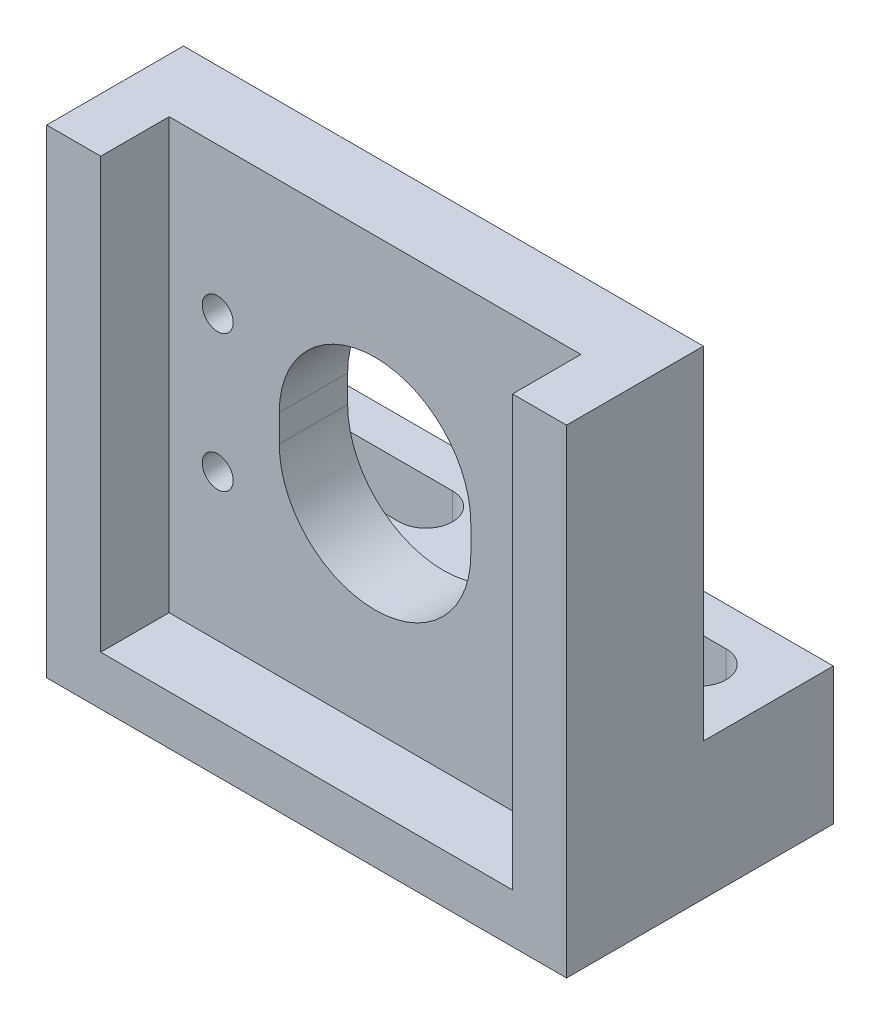
ISO-10303-21;
HEADER;
FILE_DESCRIPTION(('STEP AP214'),'2;1');
FILE_NAME('part.step','',(''),(''),'','','');
FILE_SCHEMA(('AUTOMOTIVE_DESIGN { 1 0 10303 214 1 1 1 1 }'));
ENDSEC;
DATA;
#1=APPLICATION_CONTEXT('core data for automotive mechanical design processes');
#2=APPLICATION_PROTOCOL_DEFINITION('international standard','automotive_design',2000,#1);
#3=PRODUCT_CONTEXT('',#1,'mechanical');
#4=PRODUCT('Part','Part','',(#3));
#5=PRODUCT_RELATED_PRODUCT_CATEGORY('part','',(#4));
#6=PRODUCT_DEFINITION_FORMATION('','',#4);
#7=PRODUCT_DEFINITION_CONTEXT('part definition',#1,'design');
#8=PRODUCT_DEFINITION('design','',#6,#7);
#9=PRODUCT_DEFINITION_SHAPE('','',#8);
#10=(LENGTH_UNIT() NAMED_UNIT(*) SI_UNIT(.MILLI.,.METRE.));
#11=(NAMED_UNIT(*) PLANE_ANGLE_UNIT() SI_UNIT($,.RADIAN.));
#12=(NAMED_UNIT(*) SI_UNIT($,.STERADIAN.) SOLID_ANGLE_UNIT());
#13=UNCERTAINTY_MEASURE_WITH_UNIT(LENGTH_MEASURE(1.E-05),#10,'distance_accuracy_value','');
#14=(GEOMETRIC_REPRESENTATION_CONTEXT(3) GLOBAL_UNCERTAINTY_ASSIGNED_CONTEXT((#13)) GLOBAL_UNIT_ASSIGNED_CONTEXT((#10,
#11,#12)) REPRESENTATION_CONTEXT('',''));
#15=CARTESIAN_POINT('',(0.,0.,0.));
#16=DIRECTION('',(0.,0.,1.));
#17=DIRECTION('',(1.,0.,0.));
#18=AXIS2_PLACEMENT_3D('',#15,#16,#17);
#19=CARTESIAN_POINT('',(-0.223776223776072,0.,-44.0569440559441));
#20=DIRECTION('',(1.,0.,0.));
#21=DIRECTION('',(0.,1.,0.));
#22=AXIS2_PLACEMENT_3D('',#19,#20,#21);
#23=PLANE('',#22);
#24=DIRECTION('',(0.,-1.,0.));
#25=VECTOR('',#24,1.);
#26=CARTESIAN_POINT('',(-0.223776223776072,0.,-29.5559440559441));
#27=LINE('',#26,#25);
#28=CARTESIAN_POINT('',(-0.223776223776214,20.3,-29.5559440559441));
#29=VERTEX_POINT('',#28);
#30=CARTESIAN_POINT('',(-0.223776223776203,18.3000000000001,-29.5559440559441));
#31=VERTEX_POINT('',#30);
#32=EDGE_CURVE('E89',#29,#31,#27,.T.);
#33=ORIENTED_EDGE('',*,*,#32,.F.);
#34=DIRECTION('',(0.,0.,1.));
#35=VECTOR('',#34,1.);
#36=CARTESIAN_POINT('',(-0.223776223776217,20.3000000000001,-44.0569440559441));
#37=LINE('',#36,#35);
#38=CARTESIAN_POINT('',(-0.223776223776217,20.3000000000001,-34.5559440559441));
#39=VERTEX_POINT('',#38);
#40=EDGE_CURVE('E255',#39,#29,#37,.T.);
#41=ORIENTED_EDGE('',*,*,#40,.F.);
#42=DIRECTION('',(0.,-1.,0.));
#43=VECTOR('',#42,1.);
#44=CARTESIAN_POINT('',(-0.223776223776072,0.,-34.5559440559441));
#45=LINE('',#44,#43);
#46=CARTESIAN_POINT('',(-0.223776223776205,18.3,-34.5559440559441));
#47=VERTEX_POINT('',#46);
#48=EDGE_CURVE('E259',#39,#47,#45,.T.);
#49=ORIENTED_EDGE('',*,*,#48,.T.);
#50=DIRECTION('',(0.,0.,1.));
#51=VECTOR('',#50,1.);
#52=CARTESIAN_POINT('',(-0.223776223776203,18.3000000000001,-44.0569440559441));
#53=LINE('',#52,#51);
#54=EDGE_CURVE('E268',#47,#31,#53,.T.);
#55=ORIENTED_EDGE('',*,*,#54,.T.);
#56=EDGE_LOOP('',(#33,#41,#49,#55));
#57=FACE_BOUND('',#56,.T.);
#58=ADVANCED_FACE('F64',(#57),#23,.F.);
#59=CARTESIAN_POINT('',(-7.22377622377621,20.3,-44.0569440559441));
#60=DIRECTION('',(0.,0.,1.));
#61=DIRECTION('',(1.,0.,0.));
#62=AXIS2_PLACEMENT_3D('',#59,#60,#61);
#63=CYLINDRICAL_SURFACE('',#62,7.);
#64=CARTESIAN_POINT('',(-7.22377622377621,20.3,-29.5559440559441));
#65=DIRECTION('',(0.,0.,1.));
#66=DIRECTION('',(1.,0.,0.));
#67=AXIS2_PLACEMENT_3D('',#64,#65,#66);
#68=CIRCLE('',#67,7.);
#69=CARTESIAN_POINT('',(-14.2237762237762,20.3,-29.5559440559441));
#70=VERTEX_POINT('',#69);
#71=EDGE_CURVE('E408',#70,#29,#68,.F.);
#72=ORIENTED_EDGE('',*,*,#71,.F.);
#73=DIRECTION('',(0.,0.,1.));
#74=VECTOR('',#73,1.);
#75=CARTESIAN_POINT('',(-14.2237762237762,20.3,-44.0569440559441));
#76=LINE('',#75,#74);
#77=CARTESIAN_POINT('',(-14.2237762237762,20.3,-34.5559440559441));
#78=VERTEX_POINT('',#77);
#79=EDGE_CURVE('E256',#78,#70,#76,.T.);
#80=ORIENTED_EDGE('',*,*,#79,.F.);
#81=CARTESIAN_POINT('',(-7.22377622377621,20.3,-34.5559440559441));
#82=DIRECTION('',(0.,0.,1.));
#83=DIRECTION('',(1.,0.,0.));
#84=AXIS2_PLACEMENT_3D('',#81,#82,#83);
#85=CIRCLE('',#84,7.);
#86=EDGE_CURVE('E248',#78,#39,#85,.F.);
#87=ORIENTED_EDGE('',*,*,#86,.T.);
#88=ORIENTED_EDGE('',*,*,#40,.T.);
#89=EDGE_LOOP('',(#72,#80,#87,#88));
#90=FACE_BOUND('',#89,.T.);
#91=ADVANCED_FACE('F460',(#90),#63,.F.);
#92=CARTESIAN_POINT('',(-14.223776223776,-1.23371592662125E-13,-44.0569440559441));
#93=DIRECTION('',(1.,0.,0.));
#94=DIRECTION('',(0.,1.,0.));
#95=AXIS2_PLACEMENT_3D('',#92,#93,#94);
#96=PLANE('',#95);
#97=ORIENTED_EDGE('',*,*,#79,.T.);
#98=DIRECTION('',(0.,-1.,0.));
#99=VECTOR('',#98,1.);
#100=CARTESIAN_POINT('',(-14.223776223776,-1.23371592662125E-13,-29.5559440559441));
#101=LINE('',#100,#99);
#102=CARTESIAN_POINT('',(-14.2237762237762,18.3,-29.5559440559441));
#103=VERTEX_POINT('',#102);
#104=EDGE_CURVE('E405',#70,#103,#101,.T.);
#105=ORIENTED_EDGE('',*,*,#104,.T.);
#106=DIRECTION('',(0.,0.,1.));
#107=VECTOR('',#106,1.);
#108=CARTESIAN_POINT('',(-14.2237762237762,18.3,-44.0569440559441));
#109=LINE('',#108,#107);
#110=CARTESIAN_POINT('',(-14.2237762237762,18.3,-34.5559440559441));
#111=VERTEX_POINT('',#110);
#112=EDGE_CURVE('E252',#111,#103,#109,.T.);
#113=ORIENTED_EDGE('',*,*,#112,.F.);
#114=DIRECTION('',(0.,-1.,0.));
#115=VECTOR('',#114,1.);
#116=CARTESIAN_POINT('',(-14.223776223776,-1.23371592662125E-13,-34.5559440559441));
#117=LINE('',#116,#115);
#118=EDGE_CURVE('E251',#78,#111,#117,.T.);
#119=ORIENTED_EDGE('',*,*,#118,.F.);
#120=EDGE_LOOP('',(#97,#105,#113,#119));
#121=FACE_BOUND('',#120,.T.);
#122=ADVANCED_FACE('F466',(#121),#96,.T.);
#123=CARTESIAN_POINT('',(-7.2237762237762,18.3,-44.0569440559441));
#124=DIRECTION('',(0.,0.,1.));
#125=DIRECTION('',(1.,0.,0.));
#126=AXIS2_PLACEMENT_3D('',#123,#124,#125);
#127=CYLINDRICAL_SURFACE('',#126,7.);
#128=CARTESIAN_POINT('',(-7.2237762237762,18.3,-29.5559440559441));
#129=DIRECTION('',(0.,0.,1.));
#130=DIRECTION('',(1.,0.,0.));
#131=AXIS2_PLACEMENT_3D('',#128,#129,#130);
#132=CIRCLE('',#131,7.);
#133=EDGE_CURVE('E244',#31,#103,#132,.F.);
#134=ORIENTED_EDGE('',*,*,#133,.F.);
#135=ORIENTED_EDGE('',*,*,#54,.F.);
#136=CARTESIAN_POINT('',(-7.2237762237762,18.3,-34.5559440559441));
#137=DIRECTION('',(0.,0.,1.));
#138=DIRECTION('',(1.,0.,0.));
#139=AXIS2_PLACEMENT_3D('',#136,#137,#138);
#140=CIRCLE('',#139,7.);
#141=EDGE_CURVE('E265',#47,#111,#140,.F.);
#142=ORIENTED_EDGE('',*,*,#141,.T.);
#143=ORIENTED_EDGE('',*,*,#112,.T.);
#144=EDGE_LOOP('',(#134,#135,#142,#143));
#145=FACE_BOUND('',#144,.T.);
#146=ADVANCED_FACE('F471',(#145),#127,.F.);
#147=CARTESIAN_POINT('',(0.,0.,0.));
#148=DIRECTION('',(0.,1.,0.));
#149=DIRECTION('',(0.,0.,1.));
#150=AXIS2_PLACEMENT_3D('',#147,#148,#149);
#151=PLANE('',#150);
#152=DIRECTION('',(0.,0.,1.));
#153=VECTOR('',#152,1.);
#154=CARTESIAN_POINT('',(-26.2237762237762,0.,-44.0559440559441));
#155=LINE('',#154,#153);
#156=CARTESIAN_POINT('',(-26.2237762237762,0.,-44.0559440559441));
#157=VERTEX_POINT('',#156);
#158=CARTESIAN_POINT('',(-26.2237762237762,0.,-24.5559440559441));
#159=VERTEX_POINT('',#158);
#160=EDGE_CURVE('E354',#157,#159,#155,.T.);
#161=ORIENTED_EDGE('',*,*,#160,.F.);
#162=DIRECTION('',(1.,0.,0.));
#163=VECTOR('',#162,1.);
#164=CARTESIAN_POINT('',(-26.2237762237762,0.,-44.0559440559441));
#165=LINE('',#164,#163);
#166=CARTESIAN_POINT('',(11.7762237762238,0.,-44.0559440559441));
#167=VERTEX_POINT('',#166);
#168=EDGE_CURVE('E357',#157,#167,#165,.T.);
#169=ORIENTED_EDGE('',*,*,#168,.T.);
#170=DIRECTION('',(0.,0.,1.));
#171=VECTOR('',#170,1.);
#172=CARTESIAN_POINT('',(11.7762237762238,0.,-44.0559440559441));
#173=LINE('',#172,#171);
#174=CARTESIAN_POINT('',(11.7762237762238,0.,-24.5559440559441));
#175=VERTEX_POINT('',#174);
#176=EDGE_CURVE('E370',#167,#175,#173,.T.);
#177=ORIENTED_EDGE('',*,*,#176,.T.);
#178=DIRECTION('',(1.,0.,0.));
#179=VECTOR('',#178,1.);
#180=CARTESIAN_POINT('',(-26.2237762237762,0.,-24.5559440559441));
#181=LINE('',#180,#179);
#182=EDGE_CURVE('E367',#159,#175,#181,.T.);
#183=ORIENTED_EDGE('',*,*,#182,.F.);
#184=EDGE_LOOP('',(#161,#169,#177,#183));
#185=FACE_BOUND('',#184,.T.);
#186=CARTESIAN_POINT('',(6.77622377622378,0.,-39.2709516079389));
#187=DIRECTION('',(0.,1.,0.));
#188=DIRECTION('',(0.,0.,1.));
#189=AXIS2_PLACEMENT_3D('',#186,#187,#188);
#190=CIRCLE('',#189,1.95500000000001);
#191=CARTESIAN_POINT('',(6.77622377622378,0.,-41.2259516079389));
#192=VERTEX_POINT('',#191);
#193=CARTESIAN_POINT('',(6.77622377622378,0.,-37.3159516079389));
#194=VERTEX_POINT('',#193);
#195=EDGE_CURVE('E309',#192,#194,#190,.F.);
#196=ORIENTED_EDGE('',*,*,#195,.F.);
#197=DIRECTION('',(1.,0.,0.));
#198=VECTOR('',#197,1.);
#199=CARTESIAN_POINT('',(0.,0.,-41.2259516079389));
#200=LINE('',#199,#198);
#201=CARTESIAN_POINT('',(-1.22377622377622,0.,-41.2259516079389));
#202=VERTEX_POINT('',#201);
#203=EDGE_CURVE('E312',#202,#192,#200,.T.);
#204=ORIENTED_EDGE('',*,*,#203,.F.);
#205=CARTESIAN_POINT('',(-1.22377622377622,0.,-39.2709516079389));
#206=DIRECTION('',(0.,1.,0.));
#207=DIRECTION('',(0.,0.,1.));
#208=AXIS2_PLACEMENT_3D('',#205,#206,#207);
#209=CIRCLE('',#208,1.95500000000001);
#210=CARTESIAN_POINT('',(-1.22377622377622,0.,-37.3159516079389));
#211=VERTEX_POINT('',#210);
#212=EDGE_CURVE('E277',#211,#202,#209,.F.);
#213=ORIENTED_EDGE('',*,*,#212,.F.);
#214=DIRECTION('',(1.,0.,0.));
#215=VECTOR('',#214,1.);
#216=CARTESIAN_POINT('',(0.,0.,-37.3159516079389));
#217=LINE('',#216,#215);
#218=EDGE_CURVE('E264',#211,#194,#217,.T.);
#219=ORIENTED_EDGE('',*,*,#218,.T.);
#220=EDGE_LOOP('',(#196,#204,#213,#219));
#221=FACE_BOUND('',#220,.T.);
#222=CARTESIAN_POINT('',(-13.2237762237762,0.,-39.2709516079389));
#223=DIRECTION('',(0.,1.,0.));
#224=DIRECTION('',(0.,0.,1.));
#225=AXIS2_PLACEMENT_3D('',#222,#223,#224);
#226=CIRCLE('',#225,1.95500000000001);
#227=CARTESIAN_POINT('',(-13.2237762237762,0.,-37.3159516079389));
#228=VERTEX_POINT('',#227);
#229=CARTESIAN_POINT('',(-13.2237762237762,0.,-41.2259516079389));
#230=VERTEX_POINT('',#229);
#231=EDGE_CURVE('E279',#228,#230,#226,.T.);
#232=ORIENTED_EDGE('',*,*,#231,.T.);
#233=DIRECTION('',(-1.,0.,0.));
#234=VECTOR('',#233,1.);
#235=CARTESIAN_POINT('',(0.,0.,-41.2259516079389));
#236=LINE('',#235,#234);
#237=CARTESIAN_POINT('',(-21.2237762237762,0.,-41.2259516079389));
#238=VERTEX_POINT('',#237);
#239=EDGE_CURVE('E297',#230,#238,#236,.T.);
#240=ORIENTED_EDGE('',*,*,#239,.T.);
#241=CARTESIAN_POINT('',(-21.2237762237762,0.,-39.2709516079389));
#242=DIRECTION('',(0.,1.,0.));
#243=DIRECTION('',(0.,0.,1.));
#244=AXIS2_PLACEMENT_3D('',#241,#242,#243);
#245=CIRCLE('',#244,1.95500000000001);
#246=CARTESIAN_POINT('',(-21.2237762237762,0.,-37.3159516079389));
#247=VERTEX_POINT('',#246);
#248=EDGE_CURVE('E273',#238,#247,#245,.T.);
#249=ORIENTED_EDGE('',*,*,#248,.T.);
#250=DIRECTION('',(-1.,0.,0.));
#251=VECTOR('',#250,1.);
#252=CARTESIAN_POINT('',(0.,0.,-37.3159516079389));
#253=LINE('',#252,#251);
#254=EDGE_CURVE('E276',#228,#247,#253,.T.);
#255=ORIENTED_EDGE('',*,*,#254,.F.);
#256=EDGE_LOOP('',(#232,#240,#249,#255));
#257=FACE_BOUND('',#256,.T.);
#258=ADVANCED_FACE('F433',(#185,#221,#257),#151,.F.);
#259=CARTESIAN_POINT('',(0.,10.,0.));
#260=DIRECTION('',(0.,1.,0.));
#261=DIRECTION('',(0.,0.,1.));
#262=AXIS2_PLACEMENT_3D('',#259,#260,#261);
#263=PLANE('',#262);
#264=DIRECTION('',(-1.,0.,0.));
#265=VECTOR('',#264,1.);
#266=CARTESIAN_POINT('',(0.,10.,-41.2259516079389));
#267=LINE('',#266,#265);
#268=CARTESIAN_POINT('',(6.77622377622378,10.,-41.2259516079389));
#269=VERTEX_POINT('',#268);
#270=CARTESIAN_POINT('',(-1.22377622377622,10.,-41.2259516079389));
#271=VERTEX_POINT('',#270);
#272=EDGE_CURVE('E315',#269,#271,#267,.T.);
#273=ORIENTED_EDGE('',*,*,#272,.F.);
#274=CARTESIAN_POINT('',(6.77622377622378,10.,-39.2709516079389));
#275=DIRECTION('',(0.,1.,0.));
#276=DIRECTION('',(0.,0.,1.));
#277=AXIS2_PLACEMENT_3D('',#274,#275,#276);
#278=CIRCLE('',#277,1.95500000000001);
#279=CARTESIAN_POINT('',(6.77622377622378,10.,-37.3159516079389));
#280=VERTEX_POINT('',#279);
#281=EDGE_CURVE('E323',#280,#269,#278,.T.);
#282=ORIENTED_EDGE('',*,*,#281,.F.);
#283=DIRECTION('',(-1.,0.,0.));
#284=VECTOR('',#283,1.);
#285=CARTESIAN_POINT('',(0.,10.,-37.3159516079389));
#286=LINE('',#285,#284);
#287=CARTESIAN_POINT('',(-1.22377622377622,10.,-37.3159516079389));
#288=VERTEX_POINT('',#287);
#289=EDGE_CURVE('E320',#280,#288,#286,.T.);
#290=ORIENTED_EDGE('',*,*,#289,.T.);
#291=CARTESIAN_POINT('',(-1.22377622377622,10.,-39.2709516079389));
#292=DIRECTION('',(0.,1.,0.));
#293=DIRECTION('',(0.,0.,1.));
#294=AXIS2_PLACEMENT_3D('',#291,#292,#293);
#295=CIRCLE('',#294,1.95500000000001);
#296=EDGE_CURVE('E317',#271,#288,#295,.T.);
#297=ORIENTED_EDGE('',*,*,#296,.F.);
#298=EDGE_LOOP('',(#273,#282,#290,#297));
#299=FACE_BOUND('',#298,.T.);
#300=DIRECTION('',(0.,0.,-1.));
#301=VECTOR('',#300,1.);
#302=CARTESIAN_POINT('',(-26.2237762237762,10.,-44.0559440559441));
#303=LINE('',#302,#301);
#304=CARTESIAN_POINT('',(-26.2237762237762,10.,-34.5559440559441));
#305=VERTEX_POINT('',#304);
#306=CARTESIAN_POINT('',(-26.2237762237762,10.,-44.0559440559441));
#307=VERTEX_POINT('',#306);
#308=EDGE_CURVE('E344',#305,#307,#303,.T.);
#309=ORIENTED_EDGE('',*,*,#308,.F.);
#310=DIRECTION('',(-1.,0.,0.));
#311=VECTOR('',#310,1.);
#312=CARTESIAN_POINT('',(-26.2237762237762,10.,-34.5559440559441));
#313=LINE('',#312,#311);
#314=CARTESIAN_POINT('',(11.7762237762238,10.,-34.5559440559441));
#315=VERTEX_POINT('',#314);
#316=EDGE_CURVE('E347',#315,#305,#313,.T.);
#317=ORIENTED_EDGE('',*,*,#316,.F.);
#318=DIRECTION('',(0.,0.,1.));
#319=VECTOR('',#318,1.);
#320=CARTESIAN_POINT('',(11.7762237762238,10.,-44.0559440559441));
#321=LINE('',#320,#319);
#322=CARTESIAN_POINT('',(11.7762237762238,10.,-44.0559440559441));
#323=VERTEX_POINT('',#322);
#324=EDGE_CURVE('E337',#323,#315,#321,.T.);
#325=ORIENTED_EDGE('',*,*,#324,.F.);
#326=DIRECTION('',(1.,0.,0.));
#327=VECTOR('',#326,1.);
#328=CARTESIAN_POINT('',(-26.2237762237762,10.,-44.0559440559441));
#329=LINE('',#328,#327);
#330=EDGE_CURVE('E340',#307,#323,#329,.T.);
#331=ORIENTED_EDGE('',*,*,#330,.F.);
#332=EDGE_LOOP('',(#309,#317,#325,#331));
#333=FACE_BOUND('',#332,.T.);
#334=DIRECTION('',(1.,0.,0.));
#335=VECTOR('',#334,1.);
#336=CARTESIAN_POINT('',(0.,10.,-41.2259516079389));
#337=LINE('',#336,#335);
#338=CARTESIAN_POINT('',(-21.2237762237762,10.,-41.2259516079389));
#339=VERTEX_POINT('',#338);
#340=CARTESIAN_POINT('',(-13.2237762237762,10.,-41.2259516079389));
#341=VERTEX_POINT('',#340);
#342=EDGE_CURVE('E285',#339,#341,#337,.T.);
#343=ORIENTED_EDGE('',*,*,#342,.T.);
#344=CARTESIAN_POINT('',(-13.2237762237762,10.,-39.2709516079389));
#345=DIRECTION('',(0.,1.,0.));
#346=DIRECTION('',(0.,0.,1.));
#347=AXIS2_PLACEMENT_3D('',#344,#345,#346);
#348=CIRCLE('',#347,1.95500000000001);
#349=CARTESIAN_POINT('',(-13.2237762237762,10.,-37.3159516079389));
#350=VERTEX_POINT('',#349);
#351=EDGE_CURVE('E282',#341,#350,#348,.F.);
#352=ORIENTED_EDGE('',*,*,#351,.T.);
#353=DIRECTION('',(1.,0.,0.));
#354=VECTOR('',#353,1.);
#355=CARTESIAN_POINT('',(0.,10.,-37.3159516079389));
#356=LINE('',#355,#354);
#357=CARTESIAN_POINT('',(-21.2237762237762,10.,-37.3159516079389));
#358=VERTEX_POINT('',#357);
#359=EDGE_CURVE('E291',#358,#350,#356,.T.);
#360=ORIENTED_EDGE('',*,*,#359,.F.);
#361=CARTESIAN_POINT('',(-21.2237762237762,10.,-39.2709516079389));
#362=DIRECTION('',(0.,1.,0.));
#363=DIRECTION('',(0.,0.,1.));
#364=AXIS2_PLACEMENT_3D('',#361,#362,#363);
#365=CIRCLE('',#364,1.95500000000001);
#366=EDGE_CURVE('E288',#358,#339,#365,.F.);
#367=ORIENTED_EDGE('',*,*,#366,.T.);
#368=EDGE_LOOP('',(#343,#352,#360,#367));
#369=FACE_BOUND('',#368,.T.);
#370=ADVANCED_FACE('F444',(#299,#333,#369),#263,.T.);
#371=CARTESIAN_POINT('',(-26.2237762237762,35.,-44.0559440559441));
#372=DIRECTION('',(0.,0.,-1.));
#373=DIRECTION('',(-1.,0.,0.));
#374=AXIS2_PLACEMENT_3D('',#371,#372,#373);
#375=PLANE('',#374);
#376=DIRECTION('',(0.,-1.,0.));
#377=VECTOR('',#376,1.);
#378=CARTESIAN_POINT('',(-26.2237762237762,35.,-44.0559440559441));
#379=LINE('',#378,#377);
#380=EDGE_CURVE('E364',#307,#157,#379,.T.);
#381=ORIENTED_EDGE('',*,*,#380,.F.);
#382=ORIENTED_EDGE('',*,*,#330,.T.);
#383=DIRECTION('',(0.,-1.,0.));
#384=VECTOR('',#383,1.);
#385=CARTESIAN_POINT('',(11.7762237762238,35.,-44.0559440559441));
#386=LINE('',#385,#384);
#387=EDGE_CURVE('E376',#323,#167,#386,.T.);
#388=ORIENTED_EDGE('',*,*,#387,.T.);
#389=ORIENTED_EDGE('',*,*,#168,.F.);
#390=EDGE_LOOP('',(#381,#382,#388,#389));
#391=FACE_BOUND('',#390,.T.);
#392=ADVANCED_FACE('F448',(#391),#375,.T.);
#393=CARTESIAN_POINT('',(-26.2237762237762,35.,-44.0559440559441));
#394=DIRECTION('',(1.,0.,0.));
#395=DIRECTION('',(0.,0.,-1.));
#396=AXIS2_PLACEMENT_3D('',#393,#394,#395);
#397=PLANE('',#396);
#398=DIRECTION('',(0.,0.,1.));
#399=VECTOR('',#398,1.);
#400=CARTESIAN_POINT('',(-26.2237762237762,35.,-44.0559440559441));
#401=LINE('',#400,#399);
#402=CARTESIAN_POINT('',(-26.2237762237762,35.,-34.5559440559441));
#403=VERTEX_POINT('',#402);
#404=CARTESIAN_POINT('',(-26.2237762237762,35.,-24.5559440559441));
#405=VERTEX_POINT('',#404);
#406=EDGE_CURVE('E355',#403,#405,#401,.T.);
#407=ORIENTED_EDGE('',*,*,#406,.F.);
#408=DIRECTION('',(0.,1.,0.));
#409=VECTOR('',#408,1.);
#410=CARTESIAN_POINT('',(-26.2237762237762,-39.1695034433678,-34.5559440559441));
#411=LINE('',#410,#409);
#412=EDGE_CURVE('E349',#305,#403,#411,.T.);
#413=ORIENTED_EDGE('',*,*,#412,.F.);
#414=ORIENTED_EDGE('',*,*,#308,.T.);
#415=ORIENTED_EDGE('',*,*,#380,.T.);
#416=ORIENTED_EDGE('',*,*,#160,.T.);
#417=DIRECTION('',(0.,-1.,0.));
#418=VECTOR('',#417,1.);
#419=CARTESIAN_POINT('',(-26.2237762237762,35.,-24.5559440559441));
#420=LINE('',#419,#418);
#421=EDGE_CURVE('E13',#405,#159,#420,.T.);
#422=ORIENTED_EDGE('',*,*,#421,.F.);
#423=EDGE_LOOP('',(#407,#413,#414,#415,#416,#422));
#424=FACE_BOUND('',#423,.T.);
#425=ADVANCED_FACE('F66',(#424),#397,.F.);
#426=CARTESIAN_POINT('',(-26.2237762237762,35.,-24.5559440559441));
#427=DIRECTION('',(0.,0.,-1.));
#428=DIRECTION('',(-1.,0.,0.));
#429=AXIS2_PLACEMENT_3D('',#426,#427,#428);
#430=PLANE('',#429);
#431=DIRECTION('',(1.,0.,0.));
#432=VECTOR('',#431,1.);
#433=CARTESIAN_POINT('',(-26.2237762237762,35.,-24.5559440559441));
#434=LINE('',#433,#432);
#435=CARTESIAN_POINT('',(7.82622377622379,35.,-24.5559440559441));
#436=VERTEX_POINT('',#435);
#437=CARTESIAN_POINT('',(11.7762237762238,35.,-24.5559440559441));
#438=VERTEX_POINT('',#437);
#439=EDGE_CURVE('E238',#436,#438,#434,.T.);
#440=ORIENTED_EDGE('',*,*,#439,.F.);
#441=DIRECTION('',(0.,1.,0.));
#442=VECTOR('',#441,1.);
#443=CARTESIAN_POINT('',(7.82622377622379,0.,-24.5559440559441));
#444=LINE('',#443,#442);
#445=CARTESIAN_POINT('',(7.82622377622379,3.6,-24.5559440559441));
#446=VERTEX_POINT('',#445);
#447=EDGE_CURVE('E219',#446,#436,#444,.T.);
#448=ORIENTED_EDGE('',*,*,#447,.F.);
#449=DIRECTION('',(1.,0.,0.));
#450=VECTOR('',#449,1.);
#451=CARTESIAN_POINT('',(0.,3.6,-24.5559440559441));
#452=LINE('',#451,#450);
#453=CARTESIAN_POINT('',(-22.2737762237762,3.6,-24.5559440559441));
#454=VERTEX_POINT('',#453);
#455=EDGE_CURVE('E226',#454,#446,#452,.T.);
#456=ORIENTED_EDGE('',*,*,#455,.F.);
#457=DIRECTION('',(0.,1.,0.));
#458=VECTOR('',#457,1.);
#459=CARTESIAN_POINT('',(-22.2737762237762,0.,-24.5559440559441));
#460=LINE('',#459,#458);
#461=CARTESIAN_POINT('',(-22.2737762237762,35.,-24.5559440559441));
#462=VERTEX_POINT('',#461);
#463=EDGE_CURVE('E223',#454,#462,#460,.T.);
#464=ORIENTED_EDGE('',*,*,#463,.T.);
#465=EDGE_CURVE('E358',#405,#462,#434,.T.);
#466=ORIENTED_EDGE('',*,*,#465,.F.);
#467=ORIENTED_EDGE('',*,*,#421,.T.);
#468=ORIENTED_EDGE('',*,*,#182,.T.);
#469=DIRECTION('',(0.,-1.,0.));
#470=VECTOR('',#469,1.);
#471=CARTESIAN_POINT('',(11.7762237762238,35.,-24.5559440559441));
#472=LINE('',#471,#470);
#473=EDGE_CURVE('E73',#438,#175,#472,.T.);
#474=ORIENTED_EDGE('',*,*,#473,.F.);
#475=EDGE_LOOP('',(#440,#448,#456,#464,#466,#467,#468,#474));
#476=FACE_BOUND('',#475,.T.);
#477=ADVANCED_FACE('F236',(#476),#430,.F.);
#478=CARTESIAN_POINT('',(11.7762237762238,35.,-44.0559440559441));
#479=DIRECTION('',(1.,0.,0.));
#480=DIRECTION('',(0.,0.,-1.));
#481=AXIS2_PLACEMENT_3D('',#478,#479,#480);
#482=PLANE('',#481);
#483=DIRECTION('',(0.,1.,0.));
#484=VECTOR('',#483,1.);
#485=CARTESIAN_POINT('',(11.7762237762238,-39.1695034433678,-34.5559440559441));
#486=LINE('',#485,#484);
#487=CARTESIAN_POINT('',(11.7762237762238,35.,-34.5559440559441));
#488=VERTEX_POINT('',#487);
#489=EDGE_CURVE('E341',#315,#488,#486,.T.);
#490=ORIENTED_EDGE('',*,*,#489,.T.);
#491=DIRECTION('',(0.,0.,1.));
#492=VECTOR('',#491,1.);
#493=CARTESIAN_POINT('',(11.7762237762238,35.,-44.0559440559441));
#494=LINE('',#493,#492);
#495=EDGE_CURVE('E361',#488,#438,#494,.T.);
#496=ORIENTED_EDGE('',*,*,#495,.T.);
#497=ORIENTED_EDGE('',*,*,#473,.T.);
#498=ORIENTED_EDGE('',*,*,#176,.F.);
#499=ORIENTED_EDGE('',*,*,#387,.F.);
#500=ORIENTED_EDGE('',*,*,#324,.T.);
#501=EDGE_LOOP('',(#490,#496,#497,#498,#499,#500));
#502=FACE_BOUND('',#501,.T.);
#503=ADVANCED_FACE('F438',(#502),#482,.T.);
#504=CARTESIAN_POINT('',(0.,35.,0.));
#505=DIRECTION('',(0.,1.,0.));
#506=DIRECTION('',(0.,0.,1.));
#507=AXIS2_PLACEMENT_3D('',#504,#505,#506);
#508=PLANE('',#507);
#509=DIRECTION('',(0.,0.,1.));
#510=VECTOR('',#509,1.);
#511=CARTESIAN_POINT('',(7.82622377622379,35.,-78.0527255460728));
#512=LINE('',#511,#510);
#513=CARTESIAN_POINT('',(7.82622377622379,35.,-29.5559440559441));
#514=VERTEX_POINT('',#513);
#515=EDGE_CURVE('E222',#514,#436,#512,.T.);
#516=ORIENTED_EDGE('',*,*,#515,.T.);
#517=ORIENTED_EDGE('',*,*,#439,.T.);
#518=ORIENTED_EDGE('',*,*,#495,.F.);
#519=DIRECTION('',(1.,0.,0.));
#520=VECTOR('',#519,1.);
#521=CARTESIAN_POINT('',(-26.2237762237762,35.,-34.5559440559441));
#522=LINE('',#521,#520);
#523=EDGE_CURVE('E306',#403,#488,#522,.T.);
#524=ORIENTED_EDGE('',*,*,#523,.F.);
#525=ORIENTED_EDGE('',*,*,#406,.T.);
#526=ORIENTED_EDGE('',*,*,#465,.T.);
#527=DIRECTION('',(0.,0.,1.));
#528=VECTOR('',#527,1.);
#529=CARTESIAN_POINT('',(-22.2737762237762,35.,-78.0527255460728));
#530=LINE('',#529,#528);
#531=CARTESIAN_POINT('',(-22.2737762237762,35.,-29.5559440559441));
#532=VERTEX_POINT('',#531);
#533=EDGE_CURVE('E245',#532,#462,#530,.T.);
#534=ORIENTED_EDGE('',*,*,#533,.F.);
#535=DIRECTION('',(1.,0.,0.));
#536=VECTOR('',#535,1.);
#537=CARTESIAN_POINT('',(0.,35.,-29.5559440559441));
#538=LINE('',#537,#536);
#539=EDGE_CURVE('E404',#532,#514,#538,.T.);
#540=ORIENTED_EDGE('',*,*,#539,.T.);
#541=EDGE_LOOP('',(#516,#517,#518,#524,#525,#526,#534,#540));
#542=FACE_BOUND('',#541,.T.);
#543=ADVANCED_FACE('F424',(#542),#508,.T.);
#544=CARTESIAN_POINT('',(-26.2237762237762,-39.1695034433678,-34.5559440559441));
#545=DIRECTION('',(0.,0.,1.));
#546=DIRECTION('',(1.,0.,0.));
#547=AXIS2_PLACEMENT_3D('',#544,#545,#546);
#548=PLANE('',#547);
#549=CARTESIAN_POINT('',(-18.7237762237762,24.3,-34.5559440559441));
#550=DIRECTION('',(0.,0.,1.));
#551=DIRECTION('',(1.,0.,0.));
#552=AXIS2_PLACEMENT_3D('',#549,#550,#551);
#553=CIRCLE('',#552,1.1303);
#554=CARTESIAN_POINT('',(-17.5934762237762,24.3,-34.5559440559441));
#555=VERTEX_POINT('',#554);
#556=EDGE_CURVE('E388',#555,#555,#553,.T.);
#557=ORIENTED_EDGE('',*,*,#556,.T.);
#558=EDGE_LOOP('',(#557));
#559=FACE_BOUND('',#558,.T.);
#560=CARTESIAN_POINT('',(-18.7237762237762,14.3,-34.5559440559441));
#561=DIRECTION('',(0.,0.,1.));
#562=DIRECTION('',(1.,0.,0.));
#563=AXIS2_PLACEMENT_3D('',#560,#561,#562);
#564=CIRCLE('',#563,1.1303);
#565=CARTESIAN_POINT('',(-17.5934762237762,14.3,-34.5559440559441));
#566=VERTEX_POINT('',#565);
#567=EDGE_CURVE('E385',#566,#566,#564,.T.);
#568=ORIENTED_EDGE('',*,*,#567,.T.);
#569=EDGE_LOOP('',(#568));
#570=FACE_BOUND('',#569,.T.);
#571=CARTESIAN_POINT('',(4.27622377622379,14.3,-34.5559440559441));
#572=DIRECTION('',(0.,0.,1.));
#573=DIRECTION('',(1.,0.,0.));
#574=AXIS2_PLACEMENT_3D('',#571,#572,#573);
#575=CIRCLE('',#574,1.1303);
#576=CARTESIAN_POINT('',(5.40652377622379,14.3,-34.5559440559441));
#577=VERTEX_POINT('',#576);
#578=EDGE_CURVE('E382',#577,#577,#575,.T.);
#579=ORIENTED_EDGE('',*,*,#578,.T.);
#580=EDGE_LOOP('',(#579));
#581=FACE_BOUND('',#580,.T.);
#582=CARTESIAN_POINT('',(4.27622377622379,24.3,-34.5559440559441));
#583=DIRECTION('',(0.,0.,1.));
#584=DIRECTION('',(1.,0.,0.));
#585=AXIS2_PLACEMENT_3D('',#582,#583,#584);
#586=CIRCLE('',#585,1.1303);
#587=CARTESIAN_POINT('',(5.40652377622378,24.3,-34.5559440559441));
#588=VERTEX_POINT('',#587);
#589=EDGE_CURVE('E379',#588,#588,#586,.T.);
#590=ORIENTED_EDGE('',*,*,#589,.T.);
#591=EDGE_LOOP('',(#590));
#592=FACE_BOUND('',#591,.T.);
#593=ORIENTED_EDGE('',*,*,#141,.F.);
#594=ORIENTED_EDGE('',*,*,#48,.F.);
#595=ORIENTED_EDGE('',*,*,#86,.F.);
#596=ORIENTED_EDGE('',*,*,#118,.T.);
#597=EDGE_LOOP('',(#593,#594,#595,#596));
#598=FACE_BOUND('',#597,.T.);
#599=ORIENTED_EDGE('',*,*,#316,.T.);
#600=ORIENTED_EDGE('',*,*,#412,.T.);
#601=ORIENTED_EDGE('',*,*,#523,.T.);
#602=ORIENTED_EDGE('',*,*,#489,.F.);
#603=EDGE_LOOP('',(#599,#600,#601,#602));
#604=FACE_BOUND('',#603,.T.);
#605=ADVANCED_FACE('F441',(#559,#570,#581,#592,#598,#604),#548,.F.);
#606=CARTESIAN_POINT('',(0.,-0.000999999999999265,-41.2259516079389));
#607=DIRECTION('',(0.,0.,-1.));
#608=DIRECTION('',(-1.,0.,0.));
#609=AXIS2_PLACEMENT_3D('',#606,#607,#608);
#610=PLANE('',#609);
#611=ORIENTED_EDGE('',*,*,#203,.T.);
#612=DIRECTION('',(0.,1.,0.));
#613=VECTOR('',#612,1.);
#614=CARTESIAN_POINT('',(6.77622377622378,-0.000999999999999265,-41.2259516079389));
#615=LINE('',#614,#613);
#616=EDGE_CURVE('E327',#192,#269,#615,.T.);
#617=ORIENTED_EDGE('',*,*,#616,.T.);
#618=ORIENTED_EDGE('',*,*,#272,.T.);
#619=DIRECTION('',(0.,1.,0.));
#620=VECTOR('',#619,1.);
#621=CARTESIAN_POINT('',(-1.22377622377622,-0.000999999999999265,-41.2259516079389));
#622=LINE('',#621,#620);
#623=EDGE_CURVE('E326',#202,#271,#622,.T.);
#624=ORIENTED_EDGE('',*,*,#623,.F.);
#625=EDGE_LOOP('',(#611,#617,#618,#624));
#626=FACE_BOUND('',#625,.T.);
#627=ADVANCED_FACE('F496',(#626),#610,.F.);
#628=CARTESIAN_POINT('',(6.77622377622378,-0.000999999999999265,-39.2709516079389));
#629=DIRECTION('',(0.,1.,0.));
#630=DIRECTION('',(0.,0.,1.));
#631=AXIS2_PLACEMENT_3D('',#628,#629,#630);
#632=CYLINDRICAL_SURFACE('',#631,1.95500000000001);
#633=ORIENTED_EDGE('',*,*,#195,.T.);
#634=DIRECTION('',(0.,1.,0.));
#635=VECTOR('',#634,1.);
#636=CARTESIAN_POINT('',(6.77622377622378,-0.000999999999999265,-37.3159516079389));
#637=LINE('',#636,#635);
#638=EDGE_CURVE('E329',#194,#280,#637,.T.);
#639=ORIENTED_EDGE('',*,*,#638,.T.);
#640=ORIENTED_EDGE('',*,*,#281,.T.);
#641=ORIENTED_EDGE('',*,*,#616,.F.);
#642=EDGE_LOOP('',(#633,#639,#640,#641));
#643=FACE_BOUND('',#642,.T.);
#644=ADVANCED_FACE('F492',(#643),#632,.F.);
#645=CARTESIAN_POINT('',(0.,-0.000999999999999265,-37.3159516079389));
#646=DIRECTION('',(0.,0.,-1.));
#647=DIRECTION('',(-1.,0.,0.));
#648=AXIS2_PLACEMENT_3D('',#645,#646,#647);
#649=PLANE('',#648);
#650=DIRECTION('',(0.,1.,0.));
#651=VECTOR('',#650,1.);
#652=CARTESIAN_POINT('',(-1.22377622377622,-0.000999999999999265,-37.3159516079389));
#653=LINE('',#652,#651);
#654=EDGE_CURVE('E331',#211,#288,#653,.T.);
#655=ORIENTED_EDGE('',*,*,#654,.T.);
#656=ORIENTED_EDGE('',*,*,#289,.F.);
#657=ORIENTED_EDGE('',*,*,#638,.F.);
#658=ORIENTED_EDGE('',*,*,#218,.F.);
#659=EDGE_LOOP('',(#655,#656,#657,#658));
#660=FACE_BOUND('',#659,.T.);
#661=ADVANCED_FACE('F495',(#660),#649,.T.);
#662=CARTESIAN_POINT('',(-1.22377622377622,-0.000999999999999265,-39.2709516079389));
#663=DIRECTION('',(0.,1.,0.));
#664=DIRECTION('',(0.,0.,1.));
#665=AXIS2_PLACEMENT_3D('',#662,#663,#664);
#666=CYLINDRICAL_SURFACE('',#665,1.95500000000001);
#667=ORIENTED_EDGE('',*,*,#212,.T.);
#668=ORIENTED_EDGE('',*,*,#623,.T.);
#669=ORIENTED_EDGE('',*,*,#296,.T.);
#670=ORIENTED_EDGE('',*,*,#654,.F.);
#671=EDGE_LOOP('',(#667,#668,#669,#670));
#672=FACE_BOUND('',#671,.T.);
#673=ADVANCED_FACE('F490',(#672),#666,.F.);
#674=CARTESIAN_POINT('',(-13.2237762237762,-0.000999999999999265,-39.2709516079389));
#675=DIRECTION('',(0.,1.,0.));
#676=DIRECTION('',(0.,0.,1.));
#677=AXIS2_PLACEMENT_3D('',#674,#675,#676);
#678=CYLINDRICAL_SURFACE('',#677,1.95500000000001);
#679=DIRECTION('',(0.,1.,0.));
#680=VECTOR('',#679,1.);
#681=CARTESIAN_POINT('',(-13.2237762237762,-0.000999999999999265,-37.3159516079389));
#682=LINE('',#681,#680);
#683=EDGE_CURVE('E295',#228,#350,#682,.T.);
#684=ORIENTED_EDGE('',*,*,#683,.T.);
#685=ORIENTED_EDGE('',*,*,#351,.F.);
#686=DIRECTION('',(0.,1.,0.));
#687=VECTOR('',#686,1.);
#688=CARTESIAN_POINT('',(-13.2237762237762,-0.000999999999999265,-41.2259516079389));
#689=LINE('',#688,#687);
#690=EDGE_CURVE('E294',#230,#341,#689,.T.);
#691=ORIENTED_EDGE('',*,*,#690,.F.);
#692=ORIENTED_EDGE('',*,*,#231,.F.);
#693=EDGE_LOOP('',(#684,#685,#691,#692));
#694=FACE_BOUND('',#693,.T.);
#695=ADVANCED_FACE('F479',(#694),#678,.F.);
#696=CARTESIAN_POINT('',(0.,-0.000999999999999265,-37.3159516079389));
#697=DIRECTION('',(0.,0.,1.));
#698=DIRECTION('',(1.,0.,0.));
#699=AXIS2_PLACEMENT_3D('',#696,#697,#698);
#700=PLANE('',#699);
#701=ORIENTED_EDGE('',*,*,#254,.T.);
#702=DIRECTION('',(0.,1.,0.));
#703=VECTOR('',#702,1.);
#704=CARTESIAN_POINT('',(-21.2237762237762,-0.000999999999999265,-37.3159516079389));
#705=LINE('',#704,#703);
#706=EDGE_CURVE('E298',#247,#358,#705,.T.);
#707=ORIENTED_EDGE('',*,*,#706,.T.);
#708=ORIENTED_EDGE('',*,*,#359,.T.);
#709=ORIENTED_EDGE('',*,*,#683,.F.);
#710=EDGE_LOOP('',(#701,#707,#708,#709));
#711=FACE_BOUND('',#710,.T.);
#712=ADVANCED_FACE('F475',(#711),#700,.F.);
#713=CARTESIAN_POINT('',(-21.2237762237762,-0.000999999999999265,-39.2709516079389));
#714=DIRECTION('',(0.,1.,0.));
#715=DIRECTION('',(0.,0.,1.));
#716=AXIS2_PLACEMENT_3D('',#713,#714,#715);
#717=CYLINDRICAL_SURFACE('',#716,1.95500000000001);
#718=DIRECTION('',(0.,1.,0.));
#719=VECTOR('',#718,1.);
#720=CARTESIAN_POINT('',(-21.2237762237762,-0.000999999999999265,-41.2259516079389));
#721=LINE('',#720,#719);
#722=EDGE_CURVE('E300',#238,#339,#721,.T.);
#723=ORIENTED_EDGE('',*,*,#722,.T.);
#724=ORIENTED_EDGE('',*,*,#366,.F.);
#725=ORIENTED_EDGE('',*,*,#706,.F.);
#726=ORIENTED_EDGE('',*,*,#248,.F.);
#727=EDGE_LOOP('',(#723,#724,#725,#726));
#728=FACE_BOUND('',#727,.T.);
#729=ADVANCED_FACE('F478',(#728),#717,.F.);
#730=CARTESIAN_POINT('',(0.,-0.000999999999999265,-41.2259516079389));
#731=DIRECTION('',(0.,0.,1.));
#732=DIRECTION('',(1.,0.,0.));
#733=AXIS2_PLACEMENT_3D('',#730,#731,#732);
#734=PLANE('',#733);
#735=ORIENTED_EDGE('',*,*,#690,.T.);
#736=ORIENTED_EDGE('',*,*,#342,.F.);
#737=ORIENTED_EDGE('',*,*,#722,.F.);
#738=ORIENTED_EDGE('',*,*,#239,.F.);
#739=EDGE_LOOP('',(#735,#736,#737,#738));
#740=FACE_BOUND('',#739,.T.);
#741=ADVANCED_FACE('F483',(#740),#734,.T.);
#742=CARTESIAN_POINT('',(7.82622377622379,0.,-78.0527255460728));
#743=DIRECTION('',(1.,0.,0.));
#744=DIRECTION('',(0.,0.,-1.));
#745=AXIS2_PLACEMENT_3D('',#742,#743,#744);
#746=PLANE('',#745);
#747=DIRECTION('',(0.,-1.,0.));
#748=VECTOR('',#747,1.);
#749=CARTESIAN_POINT('',(7.82622377622379,0.,-29.5559440559441));
#750=LINE('',#749,#748);
#751=CARTESIAN_POINT('',(7.82622377622379,3.6,-29.5559440559441));
#752=VERTEX_POINT('',#751);
#753=EDGE_CURVE('E81',#514,#752,#750,.T.);
#754=ORIENTED_EDGE('',*,*,#753,.T.);
#755=DIRECTION('',(0.,0.,1.));
#756=VECTOR('',#755,1.);
#757=CARTESIAN_POINT('',(7.82622377622379,3.6,-78.0527255460728));
#758=LINE('',#757,#756);
#759=EDGE_CURVE('E215',#752,#446,#758,.T.);
#760=ORIENTED_EDGE('',*,*,#759,.T.);
#761=ORIENTED_EDGE('',*,*,#447,.T.);
#762=ORIENTED_EDGE('',*,*,#515,.F.);
#763=EDGE_LOOP('',(#754,#760,#761,#762));
#764=FACE_BOUND('',#763,.T.);
#765=ADVANCED_FACE('F217',(#764),#746,.F.);
#766=CARTESIAN_POINT('',(-22.2737762237762,0.,-78.0527255460728));
#767=DIRECTION('',(1.,0.,0.));
#768=DIRECTION('',(0.,0.,-1.));
#769=AXIS2_PLACEMENT_3D('',#766,#767,#768);
#770=PLANE('',#769);
#771=ORIENTED_EDGE('',*,*,#533,.T.);
#772=ORIENTED_EDGE('',*,*,#463,.F.);
#773=DIRECTION('',(0.,0.,1.));
#774=VECTOR('',#773,1.);
#775=CARTESIAN_POINT('',(-22.2737762237762,3.6,-78.0527255460728));
#776=LINE('',#775,#774);
#777=CARTESIAN_POINT('',(-22.2737762237762,3.6,-29.5559440559441));
#778=VERTEX_POINT('',#777);
#779=EDGE_CURVE('E229',#778,#454,#776,.T.);
#780=ORIENTED_EDGE('',*,*,#779,.F.);
#781=DIRECTION('',(0.,-1.,0.));
#782=VECTOR('',#781,1.);
#783=CARTESIAN_POINT('',(-22.2737762237762,0.,-29.5559440559441));
#784=LINE('',#783,#782);
#785=EDGE_CURVE('E415',#532,#778,#784,.T.);
#786=ORIENTED_EDGE('',*,*,#785,.F.);
#787=EDGE_LOOP('',(#771,#772,#780,#786));
#788=FACE_BOUND('',#787,.T.);
#789=ADVANCED_FACE('F420',(#788),#770,.T.);
#790=CARTESIAN_POINT('',(0.,3.6,-78.0527255460728));
#791=DIRECTION('',(0.,-1.,0.));
#792=DIRECTION('',(0.,0.,-1.));
#793=AXIS2_PLACEMENT_3D('',#790,#791,#792);
#794=PLANE('',#793);
#795=DIRECTION('',(-1.,0.,0.));
#796=VECTOR('',#795,1.);
#797=CARTESIAN_POINT('',(0.,3.6,-29.5559440559441));
#798=LINE('',#797,#796);
#799=EDGE_CURVE('E409',#752,#778,#798,.T.);
#800=ORIENTED_EDGE('',*,*,#799,.T.);
#801=ORIENTED_EDGE('',*,*,#779,.T.);
#802=ORIENTED_EDGE('',*,*,#455,.T.);
#803=ORIENTED_EDGE('',*,*,#759,.F.);
#804=EDGE_LOOP('',(#800,#801,#802,#803));
#805=FACE_BOUND('',#804,.T.);
#806=ADVANCED_FACE('F227',(#805),#794,.F.);
#807=CARTESIAN_POINT('',(-26.2237762237762,-39.1695034433678,-29.5559440559441));
#808=DIRECTION('',(0.,0.,1.));
#809=DIRECTION('',(1.,0.,0.));
#810=AXIS2_PLACEMENT_3D('',#807,#808,#809);
#811=PLANE('',#810);
#812=CARTESIAN_POINT('',(-18.7237762237762,24.3,-29.5559440559441));
#813=DIRECTION('',(0.,0.,1.));
#814=DIRECTION('',(1.,0.,0.));
#815=AXIS2_PLACEMENT_3D('',#812,#813,#814);
#816=CIRCLE('',#815,1.1303);
#817=CARTESIAN_POINT('',(-17.5934762237762,24.3,-29.5559440559441));
#818=VERTEX_POINT('',#817);
#819=EDGE_CURVE('E68',#818,#818,#816,.T.);
#820=ORIENTED_EDGE('',*,*,#819,.F.);
#821=EDGE_LOOP('',(#820));
#822=FACE_BOUND('',#821,.T.);
#823=CARTESIAN_POINT('',(-18.7237762237762,14.3,-29.5559440559441));
#824=DIRECTION('',(0.,0.,1.));
#825=DIRECTION('',(1.,0.,0.));
#826=AXIS2_PLACEMENT_3D('',#823,#824,#825);
#827=CIRCLE('',#826,1.1303);
#828=CARTESIAN_POINT('',(-17.5934762237762,14.3,-29.5559440559441));
#829=VERTEX_POINT('',#828);
#830=EDGE_CURVE('E386',#829,#829,#827,.T.);
#831=ORIENTED_EDGE('',*,*,#830,.F.);
#832=EDGE_LOOP('',(#831));
#833=FACE_BOUND('',#832,.T.);
#834=CARTESIAN_POINT('',(4.27622377622379,14.3,-29.5559440559441));
#835=DIRECTION('',(0.,0.,1.));
#836=DIRECTION('',(1.,0.,0.));
#837=AXIS2_PLACEMENT_3D('',#834,#835,#836);
#838=CIRCLE('',#837,1.1303);
#839=CARTESIAN_POINT('',(5.40652377622379,14.3,-29.5559440559441));
#840=VERTEX_POINT('',#839);
#841=EDGE_CURVE('E383',#840,#840,#838,.T.);
#842=ORIENTED_EDGE('',*,*,#841,.F.);
#843=EDGE_LOOP('',(#842));
#844=FACE_BOUND('',#843,.T.);
#845=CARTESIAN_POINT('',(4.27622377622379,24.3,-29.5559440559441));
#846=DIRECTION('',(0.,0.,1.));
#847=DIRECTION('',(1.,0.,0.));
#848=AXIS2_PLACEMENT_3D('',#845,#846,#847);
#849=CIRCLE('',#848,1.1303);
#850=CARTESIAN_POINT('',(5.40652377622378,24.3,-29.5559440559441));
#851=VERTEX_POINT('',#850);
#852=EDGE_CURVE('E233',#851,#851,#849,.T.);
#853=ORIENTED_EDGE('',*,*,#852,.F.);
#854=EDGE_LOOP('',(#853));
#855=FACE_BOUND('',#854,.T.);
#856=ORIENTED_EDGE('',*,*,#799,.F.);
#857=ORIENTED_EDGE('',*,*,#753,.F.);
#858=ORIENTED_EDGE('',*,*,#539,.F.);
#859=ORIENTED_EDGE('',*,*,#785,.T.);
#860=EDGE_LOOP('',(#856,#857,#858,#859));
#861=FACE_BOUND('',#860,.T.);
#862=ORIENTED_EDGE('',*,*,#71,.T.);
#863=ORIENTED_EDGE('',*,*,#32,.T.);
#864=ORIENTED_EDGE('',*,*,#133,.T.);
#865=ORIENTED_EDGE('',*,*,#104,.F.);
#866=EDGE_LOOP('',(#862,#863,#864,#865));
#867=FACE_BOUND('',#866,.T.);
#868=ADVANCED_FACE('F417',(#822,#833,#844,#855,#861,#867),#811,.T.);
#869=CARTESIAN_POINT('',(4.27622377622379,24.3,-24.5559440559441));
#870=DIRECTION('',(0.,0.,1.));
#871=DIRECTION('',(1.,0.,0.));
#872=AXIS2_PLACEMENT_3D('',#869,#870,#871);
#873=CYLINDRICAL_SURFACE('',#872,1.1303);
#874=ORIENTED_EDGE('',*,*,#852,.T.);
#875=EDGE_LOOP('',(#874));
#876=FACE_BOUND('',#875,.T.);
#877=ORIENTED_EDGE('',*,*,#589,.F.);
#878=EDGE_LOOP('',(#877));
#879=FACE_BOUND('',#878,.T.);
#880=ADVANCED_FACE('F650',(#876,#879),#873,.F.);
#881=CARTESIAN_POINT('',(4.27622377622379,14.3,-24.5559440559441));
#882=DIRECTION('',(0.,0.,1.));
#883=DIRECTION('',(1.,0.,0.));
#884=AXIS2_PLACEMENT_3D('',#881,#882,#883);
#885=CYLINDRICAL_SURFACE('',#884,1.1303);
#886=ORIENTED_EDGE('',*,*,#841,.T.);
#887=EDGE_LOOP('',(#886));
#888=FACE_BOUND('',#887,.T.);
#889=ORIENTED_EDGE('',*,*,#578,.F.);
#890=EDGE_LOOP('',(#889));
#891=FACE_BOUND('',#890,.T.);
#892=ADVANCED_FACE('F664',(#888,#891),#885,.F.);
#893=CARTESIAN_POINT('',(-18.7237762237762,14.3,-24.5559440559441));
#894=DIRECTION('',(0.,0.,1.));
#895=DIRECTION('',(1.,0.,0.));
#896=AXIS2_PLACEMENT_3D('',#893,#894,#895);
#897=CYLINDRICAL_SURFACE('',#896,1.1303);
#898=ORIENTED_EDGE('',*,*,#830,.T.);
#899=EDGE_LOOP('',(#898));
#900=FACE_BOUND('',#899,.T.);
#901=ORIENTED_EDGE('',*,*,#567,.F.);
#902=EDGE_LOOP('',(#901));
#903=FACE_BOUND('',#902,.T.);
#904=ADVANCED_FACE('F675',(#900,#903),#897,.F.);
#905=CARTESIAN_POINT('',(-18.7237762237762,24.3,-24.5559440559441));
#906=DIRECTION('',(0.,0.,1.));
#907=DIRECTION('',(1.,0.,0.));
#908=AXIS2_PLACEMENT_3D('',#905,#906,#907);
#909=CYLINDRICAL_SURFACE('',#908,1.1303);
#910=ORIENTED_EDGE('',*,*,#819,.T.);
#911=EDGE_LOOP('',(#910));
#912=FACE_BOUND('',#911,.T.);
#913=ORIENTED_EDGE('',*,*,#556,.F.);
#914=EDGE_LOOP('',(#913));
#915=FACE_BOUND('',#914,.T.);
#916=ADVANCED_FACE('F686',(#912,#915),#909,.F.);
#917=CLOSED_SHELL('',(#58,#91,#122,#146,#258,#370,#392,#425,#477,#503,#543,#605,#627,#644,#661,
#673,#695,#712,#729,#741,#765,#789,#806,#868,#880,#892,#904,#916));
#918=MANIFOLD_SOLID_BREP('B2',#917);
#919=ADVANCED_BREP_SHAPE_REPRESENTATION('',(#18,#918),#14);
#920=SHAPE_DEFINITION_REPRESENTATION(#9,#919);
ENDSEC;
END-ISO-10303-21;
